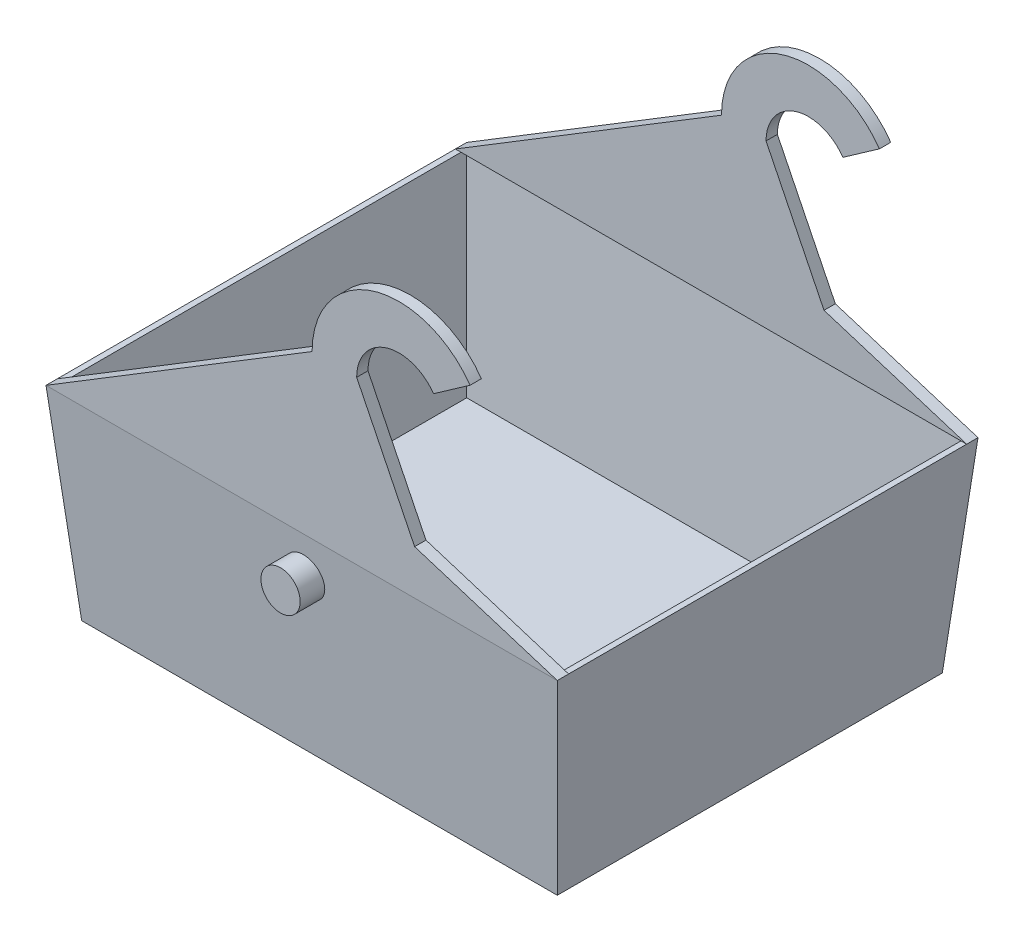
ISO-10303-21;
HEADER;
FILE_DESCRIPTION(('STEP AP214'),'2;1');
FILE_NAME('part.step','',(''),(''),'','','');
FILE_SCHEMA(('AUTOMOTIVE_DESIGN { 1 0 10303 214 1 1 1 1 }'));
ENDSEC;
DATA;
#1=APPLICATION_CONTEXT('core data for automotive mechanical design processes');
#2=APPLICATION_PROTOCOL_DEFINITION('international standard','automotive_design',2000,#1);
#3=PRODUCT_CONTEXT('',#1,'mechanical');
#4=PRODUCT('Part','Part','',(#3));
#5=PRODUCT_RELATED_PRODUCT_CATEGORY('part','',(#4));
#6=PRODUCT_DEFINITION_FORMATION('','',#4);
#7=PRODUCT_DEFINITION_CONTEXT('part definition',#1,'design');
#8=PRODUCT_DEFINITION('design','',#6,#7);
#9=PRODUCT_DEFINITION_SHAPE('','',#8);
#10=(LENGTH_UNIT() NAMED_UNIT(*) SI_UNIT(.MILLI.,.METRE.));
#11=(NAMED_UNIT(*) PLANE_ANGLE_UNIT() SI_UNIT($,.RADIAN.));
#12=(NAMED_UNIT(*) SI_UNIT($,.STERADIAN.) SOLID_ANGLE_UNIT());
#13=UNCERTAINTY_MEASURE_WITH_UNIT(LENGTH_MEASURE(1.E-05),#10,'distance_accuracy_value','');
#14=(GEOMETRIC_REPRESENTATION_CONTEXT(3) GLOBAL_UNCERTAINTY_ASSIGNED_CONTEXT((#13)) GLOBAL_UNIT_ASSIGNED_CONTEXT((#10,
#11,#12)) REPRESENTATION_CONTEXT('',''));
#15=CARTESIAN_POINT('',(0.,0.,0.));
#16=DIRECTION('',(0.,0.,1.));
#17=DIRECTION('',(1.,0.,0.));
#18=AXIS2_PLACEMENT_3D('',#15,#16,#17);
#19=CARTESIAN_POINT('',(0.,114.3,0.));
#20=DIRECTION('',(0.,-1.,0.));
#21=DIRECTION('',(0.,0.,-1.));
#22=AXIS2_PLACEMENT_3D('',#19,#20,#21);
#23=PLANE('',#22);
#24=DIRECTION('',(0.,0.,-1.));
#25=VECTOR('',#24,1.);
#26=CARTESIAN_POINT('',(-143.349954241013,114.3,0.));
#27=LINE('',#26,#25);
#28=CARTESIAN_POINT('',(-143.349954241013,114.3,-111.599954241013));
#29=VERTEX_POINT('',#28);
#30=CARTESIAN_POINT('',(-143.349954241013,114.3,111.599954241013));
#31=VERTEX_POINT('',#30);
#32=EDGE_CURVE('E367',#29,#31,#27,.F.);
#33=ORIENTED_EDGE('',*,*,#32,.T.);
#34=DIRECTION('',(1.,0.,0.));
#35=VECTOR('',#34,1.);
#36=CARTESIAN_POINT('',(-400000.,114.300000000014,111.599954241013));
#37=LINE('',#36,#35);
#38=CARTESIAN_POINT('',(-140.17495424099,114.300000000014,111.599954241013));
#39=VERTEX_POINT('',#38);
#40=EDGE_CURVE('E239',#31,#39,#37,.T.);
#41=ORIENTED_EDGE('',*,*,#40,.T.);
#42=DIRECTION('',(0.,0.,-1.));
#43=VECTOR('',#42,1.);
#44=CARTESIAN_POINT('',(-140.174954241013,114.3,0.));
#45=LINE('',#44,#43);
#46=CARTESIAN_POINT('',(-140.174954241013,114.3,-111.599954241013));
#47=VERTEX_POINT('',#46);
#48=EDGE_CURVE('E318',#39,#47,#45,.T.);
#49=ORIENTED_EDGE('',*,*,#48,.T.);
#50=DIRECTION('',(1.,0.,0.));
#51=VECTOR('',#50,1.);
#52=CARTESIAN_POINT('',(-400000.,114.300000000014,-111.599954241013));
#53=LINE('',#52,#51);
#54=EDGE_CURVE('E50',#29,#47,#53,.T.);
#55=ORIENTED_EDGE('',*,*,#54,.F.);
#56=EDGE_LOOP('',(#33,#41,#49,#55));
#57=FACE_BOUND('',#56,.T.);
#58=ADVANCED_FACE('F39',(#57),#23,.F.);
#59=DIRECTION('',(0.,0.,-1.));
#60=VECTOR('',#59,1.);
#61=CARTESIAN_POINT('',(140.174954241013,114.3,0.));
#62=LINE('',#61,#60);
#63=CARTESIAN_POINT('',(140.174954241013,114.3,111.599954241013));
#64=VERTEX_POINT('',#63);
#65=CARTESIAN_POINT('',(140.174954241013,114.3,-111.599954241013));
#66=VERTEX_POINT('',#65);
#67=EDGE_CURVE('E311',#64,#66,#62,.T.);
#68=ORIENTED_EDGE('',*,*,#67,.F.);
#69=CARTESIAN_POINT('',(143.349954241046,114.300000000014,111.599954241013));
#70=VERTEX_POINT('',#69);
#71=EDGE_CURVE('E238',#64,#70,#37,.T.);
#72=ORIENTED_EDGE('',*,*,#71,.T.);
#73=DIRECTION('',(0.,0.,1.));
#74=VECTOR('',#73,1.);
#75=CARTESIAN_POINT('',(143.349954241013,114.3,0.));
#76=LINE('',#75,#74);
#77=CARTESIAN_POINT('',(143.349954241046,114.300000000014,-111.599954241013));
#78=VERTEX_POINT('',#77);
#79=EDGE_CURVE('E350',#70,#78,#76,.F.);
#80=ORIENTED_EDGE('',*,*,#79,.T.);
#81=EDGE_CURVE('E11',#66,#78,#53,.T.);
#82=ORIENTED_EDGE('',*,*,#81,.F.);
#83=EDGE_LOOP('',(#68,#72,#80,#82));
#84=FACE_BOUND('',#83,.T.);
#85=ADVANCED_FACE('F420',(#84),#23,.F.);
#86=CARTESIAN_POINT('',(0.,0.,0.));
#87=DIRECTION('',(0.,-1.,0.));
#88=DIRECTION('',(0.,0.,-1.));
#89=AXIS2_PLACEMENT_3D('',#86,#87,#88);
#90=PLANE('',#89);
#91=DIRECTION('',(0.,0.,-1.));
#92=VECTOR('',#91,1.);
#93=CARTESIAN_POINT('',(133.35,0.,107.95));
#94=LINE('',#93,#92);
#95=CARTESIAN_POINT('',(133.35,0.,107.95));
#96=VERTEX_POINT('',#95);
#97=CARTESIAN_POINT('',(133.35,0.,-107.95));
#98=VERTEX_POINT('',#97);
#99=EDGE_CURVE('E322',#96,#98,#94,.T.);
#100=ORIENTED_EDGE('',*,*,#99,.F.);
#101=DIRECTION('',(1.,0.,0.));
#102=VECTOR('',#101,1.);
#103=CARTESIAN_POINT('',(-133.35,0.,107.95));
#104=LINE('',#103,#102);
#105=CARTESIAN_POINT('',(-133.35,0.,107.95));
#106=VERTEX_POINT('',#105);
#107=EDGE_CURVE('E348',#106,#96,#104,.T.);
#108=ORIENTED_EDGE('',*,*,#107,.F.);
#109=DIRECTION('',(0.,0.,1.));
#110=VECTOR('',#109,1.);
#111=CARTESIAN_POINT('',(-133.35,0.,107.95));
#112=LINE('',#111,#110);
#113=CARTESIAN_POINT('',(-133.35,0.,-107.95));
#114=VERTEX_POINT('',#113);
#115=EDGE_CURVE('E346',#114,#106,#112,.T.);
#116=ORIENTED_EDGE('',*,*,#115,.F.);
#117=DIRECTION('',(-1.,0.,0.));
#118=VECTOR('',#117,1.);
#119=CARTESIAN_POINT('',(-133.35,0.,-107.95));
#120=LINE('',#119,#118);
#121=EDGE_CURVE('E344',#98,#114,#120,.T.);
#122=ORIENTED_EDGE('',*,*,#121,.F.);
#123=EDGE_LOOP('',(#100,#108,#116,#122));
#124=FACE_BOUND('',#123,.T.);
#125=ADVANCED_FACE('F444',(#124),#90,.T.);
#126=CARTESIAN_POINT('',(133.35,0.,107.95));
#127=DIRECTION('',(0.996194698091746,-0.0871557427476584,0.));
#128=DIRECTION('',(0.0871557427476584,0.996194698091746,0.));
#129=AXIS2_PLACEMENT_3D('',#126,#127,#128);
#130=PLANE('',#129);
#131=ORIENTED_EDGE('',*,*,#99,.T.);
#132=DIRECTION('',(-0.0868265938642478,-0.992432509138967,0.0868265938642478));
#133=VECTOR('',#132,1.);
#134=CARTESIAN_POINT('',(131.339386730869,-22.9814148267964,-105.939386730869));
#135=LINE('',#134,#133);
#136=CARTESIAN_POINT('',(143.349954241013,114.3,-117.949954241013));
#137=VERTEX_POINT('',#136);
#138=EDGE_CURVE('E48',#137,#98,#135,.T.);
#139=ORIENTED_EDGE('',*,*,#138,.F.);
#140=DIRECTION('',(0.,0.,-1.));
#141=VECTOR('',#140,1.);
#142=CARTESIAN_POINT('',(143.349954241046,114.300000000014,-111.599954241013));
#143=LINE('',#142,#141);
#144=EDGE_CURVE('E298',#78,#137,#143,.T.);
#145=ORIENTED_EDGE('',*,*,#144,.F.);
#146=ORIENTED_EDGE('',*,*,#79,.F.);
#147=CARTESIAN_POINT('',(143.349954241013,114.3,117.949954241013));
#148=VERTEX_POINT('',#147);
#149=EDGE_CURVE('E362',#148,#70,#76,.F.);
#150=ORIENTED_EDGE('',*,*,#149,.F.);
#151=DIRECTION('',(-0.0868265938642478,-0.992432509138967,-0.0868265938642478));
#152=VECTOR('',#151,1.);
#153=CARTESIAN_POINT('',(133.35,0.,107.95));
#154=LINE('',#153,#152);
#155=EDGE_CURVE('E354',#148,#96,#154,.T.);
#156=ORIENTED_EDGE('',*,*,#155,.T.);
#157=EDGE_LOOP('',(#131,#139,#145,#146,#150,#156));
#158=FACE_BOUND('',#157,.T.);
#159=ADVANCED_FACE('F413',(#158),#130,.T.);
#160=CARTESIAN_POINT('',(-133.35,0.,-107.95));
#161=DIRECTION('',(0.,-0.0871557427476584,-0.996194698091746));
#162=DIRECTION('',(0.,0.996194698091746,-0.0871557427476584));
#163=AXIS2_PLACEMENT_3D('',#160,#161,#162);
#164=PLANE('',#163);
#165=CARTESIAN_POINT('',(0.,92.3,-116.025203643443));
#166=DIRECTION('',(0.,-0.0871557427476584,-0.996194698091746));
#167=DIRECTION('',(0.,-0.996194698091746,0.0871557427476584));
#168=AXIS2_PLACEMENT_3D('',#165,#166,#167);
#169=ELLIPSE('',#168,11.0420182129768,11.);
#170=CARTESIAN_POINT('',(0.,81.3,-115.062828344658));
#171=VERTEX_POINT('',#170);
#172=EDGE_CURVE('E43',#171,#171,#169,.F.);
#173=ORIENTED_EDGE('',*,*,#172,.T.);
#174=EDGE_LOOP('',(#173));
#175=FACE_BOUND('',#174,.T.);
#176=ORIENTED_EDGE('',*,*,#121,.T.);
#177=DIRECTION('',(0.0868265938642478,-0.992432509138967,0.0868265938642478));
#178=VECTOR('',#177,1.);
#179=CARTESIAN_POINT('',(-131.722360686894,-18.6040024788352,-106.322360686894));
#180=LINE('',#179,#178);
#181=CARTESIAN_POINT('',(-143.349954241013,114.3,-117.949954241013));
#182=VERTEX_POINT('',#181);
#183=EDGE_CURVE('E353',#182,#114,#180,.T.);
#184=ORIENTED_EDGE('',*,*,#183,.F.);
#185=DIRECTION('',(1.,0.,0.));
#186=VECTOR('',#185,1.);
#187=CARTESIAN_POINT('',(0.,114.3,-117.949954241013));
#188=LINE('',#187,#186);
#189=EDGE_CURVE('E364',#137,#182,#188,.F.);
#190=ORIENTED_EDGE('',*,*,#189,.F.);
#191=ORIENTED_EDGE('',*,*,#138,.T.);
#192=EDGE_LOOP('',(#176,#184,#190,#191));
#193=FACE_BOUND('',#192,.T.);
#194=ADVANCED_FACE('F41',(#175,#193),#164,.T.);
#195=CARTESIAN_POINT('',(-133.35,0.,107.95));
#196=DIRECTION('',(-0.996194698091746,-0.0871557427476584,0.));
#197=DIRECTION('',(0.0871557427476584,-0.996194698091746,0.));
#198=AXIS2_PLACEMENT_3D('',#195,#196,#197);
#199=PLANE('',#198);
#200=ORIENTED_EDGE('',*,*,#115,.T.);
#201=DIRECTION('',(0.0868265938642478,-0.992432509138967,-0.0868265938642478));
#202=VECTOR('',#201,1.);
#203=CARTESIAN_POINT('',(-133.35,0.,107.95));
#204=LINE('',#203,#202);
#205=CARTESIAN_POINT('',(-143.349954241013,114.3,117.949954241013));
#206=VERTEX_POINT('',#205);
#207=EDGE_CURVE('E357',#206,#106,#204,.T.);
#208=ORIENTED_EDGE('',*,*,#207,.F.);
#209=DIRECTION('',(0.,0.,1.));
#210=VECTOR('',#209,1.);
#211=CARTESIAN_POINT('',(-143.349954241013,114.3,0.));
#212=LINE('',#211,#210);
#213=EDGE_CURVE('E246',#206,#31,#212,.F.);
#214=ORIENTED_EDGE('',*,*,#213,.T.);
#215=ORIENTED_EDGE('',*,*,#32,.F.);
#216=EDGE_CURVE('E368',#182,#29,#27,.F.);
#217=ORIENTED_EDGE('',*,*,#216,.F.);
#218=ORIENTED_EDGE('',*,*,#183,.T.);
#219=EDGE_LOOP('',(#200,#208,#214,#215,#217,#218));
#220=FACE_BOUND('',#219,.T.);
#221=ADVANCED_FACE('F376',(#220),#199,.T.);
#222=CARTESIAN_POINT('',(-133.35,0.,107.95));
#223=DIRECTION('',(0.,-0.0871557427476584,0.996194698091746));
#224=DIRECTION('',(0.,-0.996194698091746,-0.0871557427476584));
#225=AXIS2_PLACEMENT_3D('',#222,#223,#224);
#226=PLANE('',#225);
#227=CARTESIAN_POINT('',(0.,92.3,116.025203643443));
#228=DIRECTION('',(0.,0.0871557427476584,-0.996194698091746));
#229=DIRECTION('',(0.,-0.996194698091746,-0.0871557427476584));
#230=AXIS2_PLACEMENT_3D('',#227,#228,#229);
#231=ELLIPSE('',#230,11.0420182129768,11.);
#232=CARTESIAN_POINT('',(0.,81.3,115.062828344658));
#233=VERTEX_POINT('',#232);
#234=EDGE_CURVE('E752',#233,#233,#231,.F.);
#235=ORIENTED_EDGE('',*,*,#234,.F.);
#236=EDGE_LOOP('',(#235));
#237=FACE_BOUND('',#236,.T.);
#238=ORIENTED_EDGE('',*,*,#107,.T.);
#239=ORIENTED_EDGE('',*,*,#155,.F.);
#240=DIRECTION('',(-1.,0.,0.));
#241=VECTOR('',#240,1.);
#242=CARTESIAN_POINT('',(0.,114.3,117.949954241013));
#243=LINE('',#242,#241);
#244=EDGE_CURVE('E209',#206,#148,#243,.F.);
#245=ORIENTED_EDGE('',*,*,#244,.F.);
#246=ORIENTED_EDGE('',*,*,#207,.T.);
#247=EDGE_LOOP('',(#238,#239,#245,#246));
#248=FACE_BOUND('',#247,.T.);
#249=ADVANCED_FACE('F447',(#237,#248),#226,.T.);
#250=CARTESIAN_POINT('',(0.,114.3,114.774954241013));
#251=DIRECTION('',(0.,-0.0871557427476584,0.996194698091746));
#252=DIRECTION('',(0.,-0.996194698091746,-0.0871557427476584));
#253=AXIS2_PLACEMENT_3D('',#250,#251,#252);
#254=PLANE('',#253);
#255=DIRECTION('',(1.,0.,0.));
#256=VECTOR('',#255,1.);
#257=CARTESIAN_POINT('',(0.,114.3,114.774954241013));
#258=LINE('',#257,#256);
#259=CARTESIAN_POINT('',(-140.174954241013,114.300000000014,114.774954241014));
#260=VERTEX_POINT('',#259);
#261=CARTESIAN_POINT('',(140.174954241014,114.300000000014,114.774954241013));
#262=VERTEX_POINT('',#261);
#263=EDGE_CURVE('E293',#260,#262,#258,.T.);
#264=ORIENTED_EDGE('',*,*,#263,.T.);
#265=DIRECTION('',(0.0868265938642478,0.992432509138967,0.0868265938642478));
#266=VECTOR('',#265,1.);
#267=CARTESIAN_POINT('',(139.118195249649,102.221189457293,113.718195249649));
#268=LINE('',#267,#266);
#269=CARTESIAN_POINT('',(130.452776506695,3.175,105.052776506695));
#270=VERTEX_POINT('',#269);
#271=EDGE_CURVE('E324',#270,#262,#268,.T.);
#272=ORIENTED_EDGE('',*,*,#271,.F.);
#273=DIRECTION('',(1.,0.,0.));
#274=VECTOR('',#273,1.);
#275=CARTESIAN_POINT('',(0.,3.175,105.052776506695));
#276=LINE('',#275,#274);
#277=CARTESIAN_POINT('',(-130.452776506695,3.175,105.052776506695));
#278=VERTEX_POINT('',#277);
#279=EDGE_CURVE('E317',#278,#270,#276,.T.);
#280=ORIENTED_EDGE('',*,*,#279,.F.);
#281=DIRECTION('',(0.0868265938642478,-0.992432509138967,-0.0868265938642478));
#282=VECTOR('',#281,1.);
#283=CARTESIAN_POINT('',(-139.118195249649,102.221189457293,113.718195249649));
#284=LINE('',#283,#282);
#285=EDGE_CURVE('E319',#278,#260,#284,.F.);
#286=ORIENTED_EDGE('',*,*,#285,.T.);
#287=EDGE_LOOP('',(#264,#272,#280,#286));
#288=FACE_BOUND('',#287,.T.);
#289=ADVANCED_FACE('F431',(#288),#254,.F.);
#290=CARTESIAN_POINT('',(-140.174954241013,114.3,0.));
#291=DIRECTION('',(-0.996194698091746,-0.0871557427476584,0.));
#292=DIRECTION('',(0.0871557427476584,-0.996194698091746,0.));
#293=AXIS2_PLACEMENT_3D('',#290,#291,#292);
#294=PLANE('',#293);
#295=EDGE_CURVE('E315',#260,#39,#45,.T.);
#296=ORIENTED_EDGE('',*,*,#295,.F.);
#297=ORIENTED_EDGE('',*,*,#285,.F.);
#298=DIRECTION('',(0.,0.,1.));
#299=VECTOR('',#298,1.);
#300=CARTESIAN_POINT('',(-130.452776506695,3.175,0.));
#301=LINE('',#300,#299);
#302=CARTESIAN_POINT('',(-130.452776506695,3.175,-105.052776506695));
#303=VERTEX_POINT('',#302);
#304=EDGE_CURVE('E328',#278,#303,#301,.F.);
#305=ORIENTED_EDGE('',*,*,#304,.T.);
#306=DIRECTION('',(-0.0868265938642478,0.992432509138967,-0.0868265938642478));
#307=VECTOR('',#306,1.);
#308=CARTESIAN_POINT('',(-139.118195249649,102.221189457293,-113.718195249649));
#309=LINE('',#308,#307);
#310=CARTESIAN_POINT('',(-140.174954241013,114.3,-114.774954241013));
#311=VERTEX_POINT('',#310);
#312=EDGE_CURVE('E323',#303,#311,#309,.T.);
#313=ORIENTED_EDGE('',*,*,#312,.T.);
#314=EDGE_CURVE('E314',#47,#311,#45,.T.);
#315=ORIENTED_EDGE('',*,*,#314,.F.);
#316=ORIENTED_EDGE('',*,*,#48,.F.);
#317=EDGE_LOOP('',(#296,#297,#305,#313,#315,#316));
#318=FACE_BOUND('',#317,.T.);
#319=ADVANCED_FACE('F436',(#318),#294,.F.);
#320=CARTESIAN_POINT('',(0.,114.3,-114.774954241013));
#321=DIRECTION('',(0.,-0.0871557427476584,-0.996194698091746));
#322=DIRECTION('',(0.,0.996194698091746,-0.0871557427476584));
#323=AXIS2_PLACEMENT_3D('',#320,#321,#322);
#324=PLANE('',#323);
#325=DIRECTION('',(1.,0.,0.));
#326=VECTOR('',#325,1.);
#327=CARTESIAN_POINT('',(0.,114.3,-114.774954241013));
#328=LINE('',#327,#326);
#329=CARTESIAN_POINT('',(140.174954241013,114.3,-114.774954241013));
#330=VERTEX_POINT('',#329);
#331=EDGE_CURVE('E310',#311,#330,#328,.T.);
#332=ORIENTED_EDGE('',*,*,#331,.F.);
#333=ORIENTED_EDGE('',*,*,#312,.F.);
#334=DIRECTION('',(-1.,0.,0.));
#335=VECTOR('',#334,1.);
#336=CARTESIAN_POINT('',(0.,3.175,-105.052776506695));
#337=LINE('',#336,#335);
#338=CARTESIAN_POINT('',(130.452776506695,3.175,-105.052776506695));
#339=VERTEX_POINT('',#338);
#340=EDGE_CURVE('E338',#303,#339,#337,.F.);
#341=ORIENTED_EDGE('',*,*,#340,.T.);
#342=DIRECTION('',(-0.0868265938642478,-0.992432509138967,0.0868265938642478));
#343=VECTOR('',#342,1.);
#344=CARTESIAN_POINT('',(139.118195249649,102.221189457293,-113.718195249649));
#345=LINE('',#344,#343);
#346=EDGE_CURVE('E327',#339,#330,#345,.F.);
#347=ORIENTED_EDGE('',*,*,#346,.T.);
#348=EDGE_LOOP('',(#332,#333,#341,#347));
#349=FACE_BOUND('',#348,.T.);
#350=ADVANCED_FACE('F511',(#349),#324,.F.);
#351=CARTESIAN_POINT('',(140.174954241013,114.3,0.));
#352=DIRECTION('',(0.996194698091746,-0.0871557427476584,0.));
#353=DIRECTION('',(0.0871557427476584,0.996194698091746,0.));
#354=AXIS2_PLACEMENT_3D('',#351,#352,#353);
#355=PLANE('',#354);
#356=EDGE_CURVE('E307',#262,#64,#62,.T.);
#357=ORIENTED_EDGE('',*,*,#356,.T.);
#358=ORIENTED_EDGE('',*,*,#67,.T.);
#359=EDGE_CURVE('E306',#66,#330,#62,.T.);
#360=ORIENTED_EDGE('',*,*,#359,.T.);
#361=ORIENTED_EDGE('',*,*,#346,.F.);
#362=DIRECTION('',(0.,0.,-1.));
#363=VECTOR('',#362,1.);
#364=CARTESIAN_POINT('',(130.452776506695,3.175,0.));
#365=LINE('',#364,#363);
#366=EDGE_CURVE('E335',#270,#339,#365,.T.);
#367=ORIENTED_EDGE('',*,*,#366,.F.);
#368=ORIENTED_EDGE('',*,*,#271,.T.);
#369=EDGE_LOOP('',(#357,#358,#360,#361,#367,#368));
#370=FACE_BOUND('',#369,.T.);
#371=ADVANCED_FACE('F427',(#370),#355,.F.);
#372=CARTESIAN_POINT('',(0.,3.175,0.));
#373=DIRECTION('',(0.,1.,0.));
#374=DIRECTION('',(0.,0.,1.));
#375=AXIS2_PLACEMENT_3D('',#372,#373,#374);
#376=PLANE('',#375);
#377=ORIENTED_EDGE('',*,*,#279,.T.);
#378=ORIENTED_EDGE('',*,*,#366,.T.);
#379=ORIENTED_EDGE('',*,*,#340,.F.);
#380=ORIENTED_EDGE('',*,*,#304,.F.);
#381=EDGE_LOOP('',(#377,#378,#379,#380));
#382=FACE_BOUND('',#381,.T.);
#383=ADVANCED_FACE('F466',(#382),#376,.T.);
#384=CARTESIAN_POINT('',(54.5499542410131,205.3,-111.599954241013));
#385=DIRECTION('',(0.,0.,-1.));
#386=DIRECTION('',(-1.,0.,0.));
#387=AXIS2_PLACEMENT_3D('',#384,#385,#386);
#388=CYLINDRICAL_SURFACE('',#387,23.7);
#389=DIRECTION('',(0.,0.,-1.));
#390=VECTOR('',#389,1.);
#391=CARTESIAN_POINT('',(30.8499542409919,205.300000000037,-111.599954241013));
#392=LINE('',#391,#390);
#393=CARTESIAN_POINT('',(30.8499542409919,205.300000000037,-111.599954241013));
#394=VERTEX_POINT('',#393);
#395=CARTESIAN_POINT('',(30.8499542409848,205.300000000037,-117.949954241013));
#396=VERTEX_POINT('',#395);
#397=EDGE_CURVE('E290',#394,#396,#392,.T.);
#398=ORIENTED_EDGE('',*,*,#397,.T.);
#399=CARTESIAN_POINT('',(54.5499542410131,205.3,-117.949954241013));
#400=DIRECTION('',(0.,0.,1.));
#401=DIRECTION('',(1.,0.,0.));
#402=AXIS2_PLACEMENT_3D('',#399,#400,#401);
#403=CIRCLE('',#402,23.7);
#404=CARTESIAN_POINT('',(73.9638576907851,218.893761541551,-117.949954241013));
#405=VERTEX_POINT('',#404);
#406=EDGE_CURVE('E270',#396,#405,#403,.F.);
#407=ORIENTED_EDGE('',*,*,#406,.T.);
#408=DIRECTION('',(0.,0.,-1.));
#409=VECTOR('',#408,1.);
#410=CARTESIAN_POINT('',(73.9638576907282,218.893761541551,-111.599954241013));
#411=LINE('',#410,#409);
#412=CARTESIAN_POINT('',(73.9638576907282,218.893761541551,-111.599954241013));
#413=VERTEX_POINT('',#412);
#414=EDGE_CURVE('E291',#413,#405,#411,.T.);
#415=ORIENTED_EDGE('',*,*,#414,.F.);
#416=CARTESIAN_POINT('',(54.5499542410131,205.3,-111.599954241013));
#417=DIRECTION('',(0.,0.,1.));
#418=DIRECTION('',(1.,0.,0.));
#419=AXIS2_PLACEMENT_3D('',#416,#417,#418);
#420=CIRCLE('',#419,23.7);
#421=EDGE_CURVE('E276',#413,#394,#420,.T.);
#422=ORIENTED_EDGE('',*,*,#421,.T.);
#423=EDGE_LOOP('',(#398,#407,#415,#422));
#424=FACE_BOUND('',#423,.T.);
#425=ADVANCED_FACE('F399',(#424),#388,.F.);
#426=CARTESIAN_POINT('',(-405297.714965803,-283625.411527395,-111.599954241013));
#427=DIRECTION('',(-0.573576436351047,0.819152044288991,0.));
#428=DIRECTION('',(-0.819152044288991,-0.573576436351047,0.));
#429=AXIS2_PLACEMENT_3D('',#426,#427,#428);
#430=PLANE('',#429);
#431=ORIENTED_EDGE('',*,*,#414,.T.);
#432=DIRECTION('',(-0.819152044288991,-0.573576436351047,0.));
#433=VECTOR('',#432,1.);
#434=CARTESIAN_POINT('',(-405297.714965803,-283625.411527395,-117.949954241013));
#435=LINE('',#434,#433);
#436=CARTESIAN_POINT('',(94.4426587979592,233.233172450355,-117.949954241013));
#437=VERTEX_POINT('',#436);
#438=EDGE_CURVE('E273',#437,#405,#435,.T.);
#439=ORIENTED_EDGE('',*,*,#438,.F.);
#440=DIRECTION('',(0.,0.,-1.));
#441=VECTOR('',#440,1.);
#442=CARTESIAN_POINT('',(94.4426587979592,233.233172450355,-111.599954241013));
#443=LINE('',#442,#441);
#444=CARTESIAN_POINT('',(94.4426587979592,233.233172450355,-111.599954241013));
#445=VERTEX_POINT('',#444);
#446=EDGE_CURVE('E294',#445,#437,#443,.T.);
#447=ORIENTED_EDGE('',*,*,#446,.F.);
#448=DIRECTION('',(0.819152044288991,0.573576436351047,0.));
#449=VECTOR('',#448,1.);
#450=CARTESIAN_POINT('',(-405297.714965803,-283625.411527395,-111.599954241013));
#451=LINE('',#450,#449);
#452=EDGE_CURVE('E288',#413,#445,#451,.T.);
#453=ORIENTED_EDGE('',*,*,#452,.F.);
#454=EDGE_LOOP('',(#431,#439,#447,#453));
#455=FACE_BOUND('',#454,.T.);
#456=ADVANCED_FACE('F395',(#455),#430,.F.);
#457=CARTESIAN_POINT('',(54.5499542410131,205.3,-111.599954241013));
#458=DIRECTION('',(0.,0.,-1.));
#459=DIRECTION('',(-1.,0.,0.));
#460=AXIS2_PLACEMENT_3D('',#457,#458,#459);
#461=CYLINDRICAL_SURFACE('',#460,48.7);
#462=ORIENTED_EDGE('',*,*,#446,.T.);
#463=CARTESIAN_POINT('',(54.5499542410131,205.3,-117.949954241013));
#464=DIRECTION('',(0.,0.,1.));
#465=DIRECTION('',(1.,0.,0.));
#466=AXIS2_PLACEMENT_3D('',#463,#464,#465);
#467=CIRCLE('',#466,48.7);
#468=CARTESIAN_POINT('',(5.84995424101312,205.299999999966,-117.949954241013));
#469=VERTEX_POINT('',#468);
#470=EDGE_CURVE('E258',#469,#437,#467,.F.);
#471=ORIENTED_EDGE('',*,*,#470,.F.);
#472=DIRECTION('',(0.,0.,-1.));
#473=VECTOR('',#472,1.);
#474=CARTESIAN_POINT('',(5.84995424101312,205.299999999966,-111.599954241013));
#475=LINE('',#474,#473);
#476=CARTESIAN_POINT('',(5.84995424101312,205.299999999966,-111.599954241013));
#477=VERTEX_POINT('',#476);
#478=EDGE_CURVE('E296',#477,#469,#475,.T.);
#479=ORIENTED_EDGE('',*,*,#478,.F.);
#480=CARTESIAN_POINT('',(54.5499542410131,205.3,-111.599954241013));
#481=DIRECTION('',(0.,0.,1.));
#482=DIRECTION('',(1.,0.,0.));
#483=AXIS2_PLACEMENT_3D('',#480,#481,#482);
#484=CIRCLE('',#483,48.7);
#485=EDGE_CURVE('E286',#445,#477,#484,.T.);
#486=ORIENTED_EDGE('',*,*,#485,.F.);
#487=EDGE_LOOP('',(#462,#471,#479,#486));
#488=FACE_BOUND('',#487,.T.);
#489=ADVANCED_FACE('F391',(#488),#461,.T.);
#490=CARTESIAN_POINT('',(-421082.694497358,-256625.001941584,-111.599954241013));
#491=DIRECTION('',(0.520709390237255,-0.853733993067364,0.));
#492=DIRECTION('',(0.853733993067364,0.520709390237255,0.));
#493=AXIS2_PLACEMENT_3D('',#490,#491,#492);
#494=PLANE('',#493);
#495=ORIENTED_EDGE('',*,*,#478,.T.);
#496=DIRECTION('',(0.853733993067364,0.520709390237255,0.));
#497=VECTOR('',#496,1.);
#498=CARTESIAN_POINT('',(-421082.694497358,-256625.001941584,-117.949954241013));
#499=LINE('',#498,#497);
#500=EDGE_CURVE('E261',#182,#469,#499,.T.);
#501=ORIENTED_EDGE('',*,*,#500,.F.);
#502=ORIENTED_EDGE('',*,*,#216,.T.);
#503=DIRECTION('',(-0.853733993067364,-0.520709390237255,0.));
#504=VECTOR('',#503,1.);
#505=CARTESIAN_POINT('',(-421082.694497358,-256625.001941584,-111.599954241013));
#506=LINE('',#505,#504);
#507=EDGE_CURVE('E283',#477,#29,#506,.T.);
#508=ORIENTED_EDGE('',*,*,#507,.F.);
#509=EDGE_LOOP('',(#495,#501,#502,#508));
#510=FACE_BOUND('',#509,.T.);
#511=ADVANCED_FACE('F385',(#510),#494,.F.);
#512=CARTESIAN_POINT('',(-400000.,114.300000000014,-111.599954241013));
#513=DIRECTION('',(0.,1.,0.));
#514=DIRECTION('',(0.,0.,1.));
#515=AXIS2_PLACEMENT_3D('',#512,#513,#514);
#516=PLANE('',#515);
#517=ORIENTED_EDGE('',*,*,#359,.F.);
#518=EDGE_CURVE('E51',#47,#66,#53,.T.);
#519=ORIENTED_EDGE('',*,*,#518,.F.);
#520=ORIENTED_EDGE('',*,*,#314,.T.);
#521=ORIENTED_EDGE('',*,*,#331,.T.);
#522=EDGE_LOOP('',(#517,#519,#520,#521));
#523=FACE_BOUND('',#522,.T.);
#524=ADVANCED_FACE('F423',(#523),#516,.F.);
#525=CARTESIAN_POINT('',(-281466.069905539,88117.2437061812,-111.599954241013));
#526=DIRECTION('',(-0.298274993135947,-0.95447997803503,0.));
#527=DIRECTION('',(0.95447997803503,-0.298274993135947,0.));
#528=AXIS2_PLACEMENT_3D('',#525,#526,#527);
#529=PLANE('',#528);
#530=ORIENTED_EDGE('',*,*,#144,.T.);
#531=DIRECTION('',(0.95447997803503,-0.298274993135947,0.));
#532=VECTOR('',#531,1.);
#533=CARTESIAN_POINT('',(-281466.069905539,88117.2437061812,-117.949954241013));
#534=LINE('',#533,#532);
#535=CARTESIAN_POINT('',(63.349954241005,139.299999999935,-117.949954241013));
#536=VERTEX_POINT('',#535);
#537=EDGE_CURVE('E264',#536,#137,#534,.T.);
#538=ORIENTED_EDGE('',*,*,#537,.F.);
#539=DIRECTION('',(0.,0.,-1.));
#540=VECTOR('',#539,1.);
#541=CARTESIAN_POINT('',(63.349954241005,139.299999999949,-111.599954241013));
#542=LINE('',#541,#540);
#543=CARTESIAN_POINT('',(63.349954241005,139.299999999949,-111.599954241013));
#544=VERTEX_POINT('',#543);
#545=EDGE_CURVE('E301',#544,#536,#542,.T.);
#546=ORIENTED_EDGE('',*,*,#545,.F.);
#547=DIRECTION('',(-0.95447997803503,0.298274993135947,0.));
#548=VECTOR('',#547,1.);
#549=CARTESIAN_POINT('',(-281466.069905539,88117.2437061812,-111.599954241013));
#550=LINE('',#549,#548);
#551=EDGE_CURVE('E281',#78,#544,#550,.T.);
#552=ORIENTED_EDGE('',*,*,#551,.F.);
#553=EDGE_LOOP('',(#530,#538,#546,#552));
#554=FACE_BOUND('',#553,.T.);
#555=ADVANCED_FACE('F407',(#554),#529,.F.);
#556=CARTESIAN_POINT('',(37448.4104243698,-75781.1304931847,-111.599954241013));
#557=DIRECTION('',(-0.89712923831968,-0.441768185536206,0.));
#558=DIRECTION('',(0.441768185536206,-0.89712923831968,0.));
#559=AXIS2_PLACEMENT_3D('',#556,#557,#558);
#560=PLANE('',#559);
#561=ORIENTED_EDGE('',*,*,#545,.T.);
#562=DIRECTION('',(0.441768185536206,-0.89712923831968,0.));
#563=VECTOR('',#562,1.);
#564=CARTESIAN_POINT('',(37448.4104243698,-75781.1304931847,-117.949954241013));
#565=LINE('',#564,#563);
#566=EDGE_CURVE('E267',#396,#536,#565,.T.);
#567=ORIENTED_EDGE('',*,*,#566,.F.);
#568=ORIENTED_EDGE('',*,*,#397,.F.);
#569=DIRECTION('',(-0.441768185536206,0.89712923831968,0.));
#570=VECTOR('',#569,1.);
#571=CARTESIAN_POINT('',(37448.4104243698,-75781.1304931847,-111.599954241013));
#572=LINE('',#571,#570);
#573=EDGE_CURVE('E279',#544,#394,#572,.T.);
#574=ORIENTED_EDGE('',*,*,#573,.F.);
#575=EDGE_LOOP('',(#561,#567,#568,#574));
#576=FACE_BOUND('',#575,.T.);
#577=ADVANCED_FACE('F403',(#576),#560,.F.);
#578=CARTESIAN_POINT('',(54.5499542410131,205.3,-111.599954241013));
#579=DIRECTION('',(0.,0.,1.));
#580=DIRECTION('',(1.,0.,0.));
#581=AXIS2_PLACEMENT_3D('',#578,#579,#580);
#582=PLANE('',#581);
#583=ORIENTED_EDGE('',*,*,#421,.F.);
#584=ORIENTED_EDGE('',*,*,#452,.T.);
#585=ORIENTED_EDGE('',*,*,#485,.T.);
#586=ORIENTED_EDGE('',*,*,#507,.T.);
#587=ORIENTED_EDGE('',*,*,#54,.T.);
#588=ORIENTED_EDGE('',*,*,#518,.T.);
#589=ORIENTED_EDGE('',*,*,#81,.T.);
#590=ORIENTED_EDGE('',*,*,#551,.T.);
#591=ORIENTED_EDGE('',*,*,#573,.T.);
#592=EDGE_LOOP('',(#583,#584,#585,#586,#587,#588,#589,#590,#591));
#593=FACE_BOUND('',#592,.T.);
#594=ADVANCED_FACE('F381',(#593),#582,.T.);
#595=CARTESIAN_POINT('',(0.,0.,-117.949954241013));
#596=DIRECTION('',(0.,0.,1.));
#597=DIRECTION('',(1.,0.,0.));
#598=AXIS2_PLACEMENT_3D('',#595,#596,#597);
#599=PLANE('',#598);
#600=ORIENTED_EDGE('',*,*,#566,.T.);
#601=ORIENTED_EDGE('',*,*,#537,.T.);
#602=ORIENTED_EDGE('',*,*,#189,.T.);
#603=ORIENTED_EDGE('',*,*,#500,.T.);
#604=ORIENTED_EDGE('',*,*,#470,.T.);
#605=ORIENTED_EDGE('',*,*,#438,.T.);
#606=ORIENTED_EDGE('',*,*,#406,.F.);
#607=EDGE_LOOP('',(#600,#601,#602,#603,#604,#605,#606));
#608=FACE_BOUND('',#607,.T.);
#609=ADVANCED_FACE('F389',(#608),#599,.F.);
#610=CARTESIAN_POINT('',(0.,92.3,-129.774954241013));
#611=DIRECTION('',(0.,0.,1.));
#612=DIRECTION('',(1.,0.,0.));
#613=AXIS2_PLACEMENT_3D('',#610,#611,#612);
#614=CYLINDRICAL_SURFACE('',#613,11.);
#615=CARTESIAN_POINT('',(0.,92.3,-129.774954241013));
#616=DIRECTION('',(0.,0.,1.));
#617=DIRECTION('',(1.,0.,0.));
#618=AXIS2_PLACEMENT_3D('',#615,#616,#617);
#619=CIRCLE('',#618,11.);
#620=CARTESIAN_POINT('',(11.,92.3,-129.774954241013));
#621=VERTEX_POINT('',#620);
#622=EDGE_CURVE('E255',#621,#621,#619,.T.);
#623=ORIENTED_EDGE('',*,*,#622,.T.);
#624=EDGE_LOOP('',(#623));
#625=FACE_BOUND('',#624,.T.);
#626=ORIENTED_EDGE('',*,*,#172,.F.);
#627=EDGE_LOOP('',(#626));
#628=FACE_BOUND('',#627,.T.);
#629=ADVANCED_FACE('F481',(#625,#628),#614,.T.);
#630=CARTESIAN_POINT('',(0.,92.3,-129.774954241013));
#631=DIRECTION('',(0.,0.,1.));
#632=DIRECTION('',(1.,0.,0.));
#633=AXIS2_PLACEMENT_3D('',#630,#631,#632);
#634=PLANE('',#633);
#635=ORIENTED_EDGE('',*,*,#622,.F.);
#636=EDGE_LOOP('',(#635));
#637=FACE_BOUND('',#636,.T.);
#638=ADVANCED_FACE('F482',(#637),#634,.F.);
#639=CARTESIAN_POINT('',(54.5499542410131,205.3,111.599954241013));
#640=DIRECTION('',(0.,0.,1.));
#641=DIRECTION('',(-1.,0.,0.));
#642=AXIS2_PLACEMENT_3D('',#639,#640,#641);
#643=CYLINDRICAL_SURFACE('',#642,23.7);
#644=DIRECTION('',(0.,0.,1.));
#645=VECTOR('',#644,1.);
#646=CARTESIAN_POINT('',(30.8499542409919,205.300000000037,111.599954241013));
#647=LINE('',#646,#645);
#648=CARTESIAN_POINT('',(30.8499542409919,205.300000000037,111.599954241013));
#649=VERTEX_POINT('',#648);
#650=CARTESIAN_POINT('',(30.8499542409848,205.300000000037,117.949954241013));
#651=VERTEX_POINT('',#650);
#652=EDGE_CURVE('E199',#649,#651,#647,.T.);
#653=ORIENTED_EDGE('',*,*,#652,.F.);
#654=CARTESIAN_POINT('',(54.5499542410131,205.3,111.599954241013));
#655=DIRECTION('',(0.,0.,1.));
#656=DIRECTION('',(1.,0.,0.));
#657=AXIS2_PLACEMENT_3D('',#654,#655,#656);
#658=CIRCLE('',#657,23.7);
#659=CARTESIAN_POINT('',(73.9638576907282,218.893761541551,111.599954241013));
#660=VERTEX_POINT('',#659);
#661=EDGE_CURVE('E226',#660,#649,#658,.T.);
#662=ORIENTED_EDGE('',*,*,#661,.F.);
#663=DIRECTION('',(0.,0.,1.));
#664=VECTOR('',#663,1.);
#665=CARTESIAN_POINT('',(73.9638576907282,218.893761541551,111.599954241013));
#666=LINE('',#665,#664);
#667=CARTESIAN_POINT('',(73.9638576907851,218.893761541551,117.949954241013));
#668=VERTEX_POINT('',#667);
#669=EDGE_CURVE('E252',#660,#668,#666,.T.);
#670=ORIENTED_EDGE('',*,*,#669,.T.);
#671=CARTESIAN_POINT('',(54.5499542410131,205.3,117.949954241013));
#672=DIRECTION('',(0.,0.,1.));
#673=DIRECTION('',(1.,0.,0.));
#674=AXIS2_PLACEMENT_3D('',#671,#672,#673);
#675=CIRCLE('',#674,23.7);
#676=EDGE_CURVE('E217',#651,#668,#675,.F.);
#677=ORIENTED_EDGE('',*,*,#676,.F.);
#678=EDGE_LOOP('',(#653,#662,#670,#677));
#679=FACE_BOUND('',#678,.T.);
#680=ADVANCED_FACE('F487',(#679),#643,.F.);
#681=CARTESIAN_POINT('',(-405297.714965803,-283625.411527395,111.599954241013));
#682=DIRECTION('',(-0.573576436351047,0.819152044288991,0.));
#683=DIRECTION('',(-0.819152044288991,-0.573576436351047,0.));
#684=AXIS2_PLACEMENT_3D('',#681,#682,#683);
#685=PLANE('',#684);
#686=ORIENTED_EDGE('',*,*,#669,.F.);
#687=DIRECTION('',(0.819152044288991,0.573576436351047,0.));
#688=VECTOR('',#687,1.);
#689=CARTESIAN_POINT('',(-405297.714965803,-283625.411527395,111.599954241013));
#690=LINE('',#689,#688);
#691=CARTESIAN_POINT('',(94.4426587979592,233.233172450355,111.599954241013));
#692=VERTEX_POINT('',#691);
#693=EDGE_CURVE('E229',#660,#692,#690,.T.);
#694=ORIENTED_EDGE('',*,*,#693,.T.);
#695=DIRECTION('',(0.,0.,1.));
#696=VECTOR('',#695,1.);
#697=CARTESIAN_POINT('',(94.4426587979592,233.233172450355,111.599954241013));
#698=LINE('',#697,#696);
#699=CARTESIAN_POINT('',(94.4426587979592,233.233172450355,117.949954241013));
#700=VERTEX_POINT('',#699);
#701=EDGE_CURVE('E249',#692,#700,#698,.T.);
#702=ORIENTED_EDGE('',*,*,#701,.T.);
#703=DIRECTION('',(-0.819152044288991,-0.573576436351047,0.));
#704=VECTOR('',#703,1.);
#705=CARTESIAN_POINT('',(-405297.714965803,-283625.411527395,117.949954241013));
#706=LINE('',#705,#704);
#707=EDGE_CURVE('E221',#700,#668,#706,.T.);
#708=ORIENTED_EDGE('',*,*,#707,.T.);
#709=EDGE_LOOP('',(#686,#694,#702,#708));
#710=FACE_BOUND('',#709,.T.);
#711=ADVANCED_FACE('F533',(#710),#685,.F.);
#712=CARTESIAN_POINT('',(54.5499542410131,205.3,111.599954241013));
#713=DIRECTION('',(0.,0.,1.));
#714=DIRECTION('',(-1.,0.,0.));
#715=AXIS2_PLACEMENT_3D('',#712,#713,#714);
#716=CYLINDRICAL_SURFACE('',#715,48.7);
#717=ORIENTED_EDGE('',*,*,#701,.F.);
#718=CARTESIAN_POINT('',(54.5499542410131,205.3,111.599954241013));
#719=DIRECTION('',(0.,0.,1.));
#720=DIRECTION('',(1.,0.,0.));
#721=AXIS2_PLACEMENT_3D('',#718,#719,#720);
#722=CIRCLE('',#721,48.7);
#723=CARTESIAN_POINT('',(5.84995424101312,205.299999999966,111.599954241013));
#724=VERTEX_POINT('',#723);
#725=EDGE_CURVE('E232',#692,#724,#722,.T.);
#726=ORIENTED_EDGE('',*,*,#725,.T.);
#727=DIRECTION('',(0.,0.,1.));
#728=VECTOR('',#727,1.);
#729=CARTESIAN_POINT('',(5.84995424101312,205.299999999966,111.599954241013));
#730=LINE('',#729,#728);
#731=CARTESIAN_POINT('',(5.84995424101312,205.299999999966,117.949954241013));
#732=VERTEX_POINT('',#731);
#733=EDGE_CURVE('E243',#724,#732,#730,.T.);
#734=ORIENTED_EDGE('',*,*,#733,.T.);
#735=CARTESIAN_POINT('',(54.5499542410131,205.3,117.949954241013));
#736=DIRECTION('',(0.,0.,1.));
#737=DIRECTION('',(1.,0.,0.));
#738=AXIS2_PLACEMENT_3D('',#735,#736,#737);
#739=CIRCLE('',#738,48.7);
#740=EDGE_CURVE('E758',#732,#700,#739,.F.);
#741=ORIENTED_EDGE('',*,*,#740,.T.);
#742=EDGE_LOOP('',(#717,#726,#734,#741));
#743=FACE_BOUND('',#742,.T.);
#744=ADVANCED_FACE('F541',(#743),#716,.T.);
#745=CARTESIAN_POINT('',(-421082.694497358,-256625.001941584,111.599954241013));
#746=DIRECTION('',(0.520709390237255,-0.853733993067364,0.));
#747=DIRECTION('',(0.853733993067364,0.520709390237255,0.));
#748=AXIS2_PLACEMENT_3D('',#745,#746,#747);
#749=PLANE('',#748);
#750=ORIENTED_EDGE('',*,*,#733,.F.);
#751=DIRECTION('',(-0.853733993067364,-0.520709390237255,0.));
#752=VECTOR('',#751,1.);
#753=CARTESIAN_POINT('',(-421082.694497358,-256625.001941584,111.599954241013));
#754=LINE('',#753,#752);
#755=EDGE_CURVE('E235',#724,#31,#754,.T.);
#756=ORIENTED_EDGE('',*,*,#755,.T.);
#757=ORIENTED_EDGE('',*,*,#213,.F.);
#758=DIRECTION('',(0.853733993067364,0.520709390237255,0.));
#759=VECTOR('',#758,1.);
#760=CARTESIAN_POINT('',(-421082.694497358,-256625.001941584,117.949954241013));
#761=LINE('',#760,#759);
#762=EDGE_CURVE('E213',#206,#732,#761,.T.);
#763=ORIENTED_EDGE('',*,*,#762,.T.);
#764=EDGE_LOOP('',(#750,#756,#757,#763));
#765=FACE_BOUND('',#764,.T.);
#766=ADVANCED_FACE('F550',(#765),#749,.F.);
#767=CARTESIAN_POINT('',(-400000.,114.300000000014,111.599954241013));
#768=DIRECTION('',(0.,1.,0.));
#769=DIRECTION('',(0.,0.,-1.));
#770=AXIS2_PLACEMENT_3D('',#767,#768,#769);
#771=PLANE('',#770);
#772=ORIENTED_EDGE('',*,*,#295,.T.);
#773=EDGE_CURVE('E58',#39,#64,#37,.T.);
#774=ORIENTED_EDGE('',*,*,#773,.T.);
#775=ORIENTED_EDGE('',*,*,#356,.F.);
#776=ORIENTED_EDGE('',*,*,#263,.F.);
#777=EDGE_LOOP('',(#772,#774,#775,#776));
#778=FACE_BOUND('',#777,.T.);
#779=ADVANCED_FACE('F429',(#778),#771,.F.);
#780=CARTESIAN_POINT('',(-281466.069905539,88117.2437061812,111.599954241013));
#781=DIRECTION('',(-0.298274993135947,-0.95447997803503,0.));
#782=DIRECTION('',(0.95447997803503,-0.298274993135947,0.));
#783=AXIS2_PLACEMENT_3D('',#780,#781,#782);
#784=PLANE('',#783);
#785=ORIENTED_EDGE('',*,*,#149,.T.);
#786=DIRECTION('',(-0.95447997803503,0.298274993135947,0.));
#787=VECTOR('',#786,1.);
#788=CARTESIAN_POINT('',(-281466.069905539,88117.2437061812,111.599954241013));
#789=LINE('',#788,#787);
#790=CARTESIAN_POINT('',(63.349954241005,139.299999999949,111.599954241013));
#791=VERTEX_POINT('',#790);
#792=EDGE_CURVE('E216',#70,#791,#789,.T.);
#793=ORIENTED_EDGE('',*,*,#792,.T.);
#794=DIRECTION('',(0.,0.,1.));
#795=VECTOR('',#794,1.);
#796=CARTESIAN_POINT('',(63.349954241005,139.299999999949,111.599954241013));
#797=LINE('',#796,#795);
#798=CARTESIAN_POINT('',(63.349954241005,139.299999999935,117.949954241013));
#799=VERTEX_POINT('',#798);
#800=EDGE_CURVE('E196',#791,#799,#797,.T.);
#801=ORIENTED_EDGE('',*,*,#800,.T.);
#802=DIRECTION('',(0.95447997803503,-0.298274993135947,0.));
#803=VECTOR('',#802,1.);
#804=CARTESIAN_POINT('',(-281466.069905539,88117.2437061812,117.949954241013));
#805=LINE('',#804,#803);
#806=EDGE_CURVE('E203',#799,#148,#805,.T.);
#807=ORIENTED_EDGE('',*,*,#806,.T.);
#808=EDGE_LOOP('',(#785,#793,#801,#807));
#809=FACE_BOUND('',#808,.T.);
#810=ADVANCED_FACE('F215',(#809),#784,.F.);
#811=CARTESIAN_POINT('',(54.5499542410131,205.3,111.599954241013));
#812=DIRECTION('',(0.,0.,-1.));
#813=DIRECTION('',(1.,0.,0.));
#814=AXIS2_PLACEMENT_3D('',#811,#812,#813);
#815=PLANE('',#814);
#816=ORIENTED_EDGE('',*,*,#661,.T.);
#817=DIRECTION('',(-0.441768185536206,0.89712923831968,0.));
#818=VECTOR('',#817,1.);
#819=CARTESIAN_POINT('',(37448.4104243698,-75781.1304931847,111.599954241013));
#820=LINE('',#819,#818);
#821=EDGE_CURVE('E219',#791,#649,#820,.T.);
#822=ORIENTED_EDGE('',*,*,#821,.F.);
#823=ORIENTED_EDGE('',*,*,#792,.F.);
#824=ORIENTED_EDGE('',*,*,#71,.F.);
#825=ORIENTED_EDGE('',*,*,#773,.F.);
#826=ORIENTED_EDGE('',*,*,#40,.F.);
#827=ORIENTED_EDGE('',*,*,#755,.F.);
#828=ORIENTED_EDGE('',*,*,#725,.F.);
#829=ORIENTED_EDGE('',*,*,#693,.F.);
#830=EDGE_LOOP('',(#816,#822,#823,#824,#825,#826,#827,#828,#829));
#831=FACE_BOUND('',#830,.T.);
#832=ADVANCED_FACE('F439',(#831),#815,.T.);
#833=CARTESIAN_POINT('',(37448.4104243698,-75781.1304931847,111.599954241013));
#834=DIRECTION('',(-0.89712923831968,-0.441768185536206,0.));
#835=DIRECTION('',(0.441768185536206,-0.89712923831968,0.));
#836=AXIS2_PLACEMENT_3D('',#833,#834,#835);
#837=PLANE('',#836);
#838=ORIENTED_EDGE('',*,*,#800,.F.);
#839=ORIENTED_EDGE('',*,*,#821,.T.);
#840=ORIENTED_EDGE('',*,*,#652,.T.);
#841=DIRECTION('',(0.441768185536206,-0.89712923831968,0.));
#842=VECTOR('',#841,1.);
#843=CARTESIAN_POINT('',(37448.4104243698,-75781.1304931847,117.949954241013));
#844=LINE('',#843,#842);
#845=EDGE_CURVE('E192',#651,#799,#844,.T.);
#846=ORIENTED_EDGE('',*,*,#845,.T.);
#847=EDGE_LOOP('',(#838,#839,#840,#846));
#848=FACE_BOUND('',#847,.T.);
#849=ADVANCED_FACE('F194',(#848),#837,.F.);
#850=CARTESIAN_POINT('',(0.,0.,117.949954241013));
#851=DIRECTION('',(0.,0.,-1.));
#852=DIRECTION('',(1.,0.,0.));
#853=AXIS2_PLACEMENT_3D('',#850,#851,#852);
#854=PLANE('',#853);
#855=ORIENTED_EDGE('',*,*,#845,.F.);
#856=ORIENTED_EDGE('',*,*,#676,.T.);
#857=ORIENTED_EDGE('',*,*,#707,.F.);
#858=ORIENTED_EDGE('',*,*,#740,.F.);
#859=ORIENTED_EDGE('',*,*,#762,.F.);
#860=ORIENTED_EDGE('',*,*,#244,.T.);
#861=ORIENTED_EDGE('',*,*,#806,.F.);
#862=EDGE_LOOP('',(#855,#856,#857,#858,#859,#860,#861));
#863=FACE_BOUND('',#862,.T.);
#864=ADVANCED_FACE('F207',(#863),#854,.F.);
#865=CARTESIAN_POINT('',(0.,92.3,129.774954241013));
#866=DIRECTION('',(0.,0.,-1.));
#867=DIRECTION('',(1.,0.,0.));
#868=AXIS2_PLACEMENT_3D('',#865,#866,#867);
#869=CYLINDRICAL_SURFACE('',#868,11.);
#870=CARTESIAN_POINT('',(0.,92.3,129.774954241013));
#871=DIRECTION('',(0.,0.,1.));
#872=DIRECTION('',(1.,0.,0.));
#873=AXIS2_PLACEMENT_3D('',#870,#871,#872);
#874=CIRCLE('',#873,11.);
#875=CARTESIAN_POINT('',(11.,92.3,129.774954241013));
#876=VERTEX_POINT('',#875);
#877=EDGE_CURVE('E204',#876,#876,#874,.T.);
#878=ORIENTED_EDGE('',*,*,#877,.F.);
#879=EDGE_LOOP('',(#878));
#880=FACE_BOUND('',#879,.T.);
#881=ORIENTED_EDGE('',*,*,#234,.T.);
#882=EDGE_LOOP('',(#881));
#883=FACE_BOUND('',#882,.T.);
#884=ADVANCED_FACE('F595',(#880,#883),#869,.T.);
#885=CARTESIAN_POINT('',(0.,92.3,129.774954241013));
#886=DIRECTION('',(0.,0.,-1.));
#887=DIRECTION('',(1.,0.,0.));
#888=AXIS2_PLACEMENT_3D('',#885,#886,#887);
#889=PLANE('',#888);
#890=ORIENTED_EDGE('',*,*,#877,.T.);
#891=EDGE_LOOP('',(#890));
#892=FACE_BOUND('',#891,.T.);
#893=ADVANCED_FACE('F603',(#892),#889,.F.);
#894=CLOSED_SHELL('',(#58,#85,#125,#159,#194,#221,#249,#289,#319,#350,#371,#383,#425,#456,#489,
#511,#524,#555,#577,#594,#609,#629,#638,#680,#711,#744,#766,#779,#810,#832,#849,#864,#884,#893));
#895=MANIFOLD_SOLID_BREP('B2',#894);
#896=ADVANCED_BREP_SHAPE_REPRESENTATION('',(#18,#895),#14);
#897=SHAPE_DEFINITION_REPRESENTATION(#9,#896);
ENDSEC;
END-ISO-10303-21;
